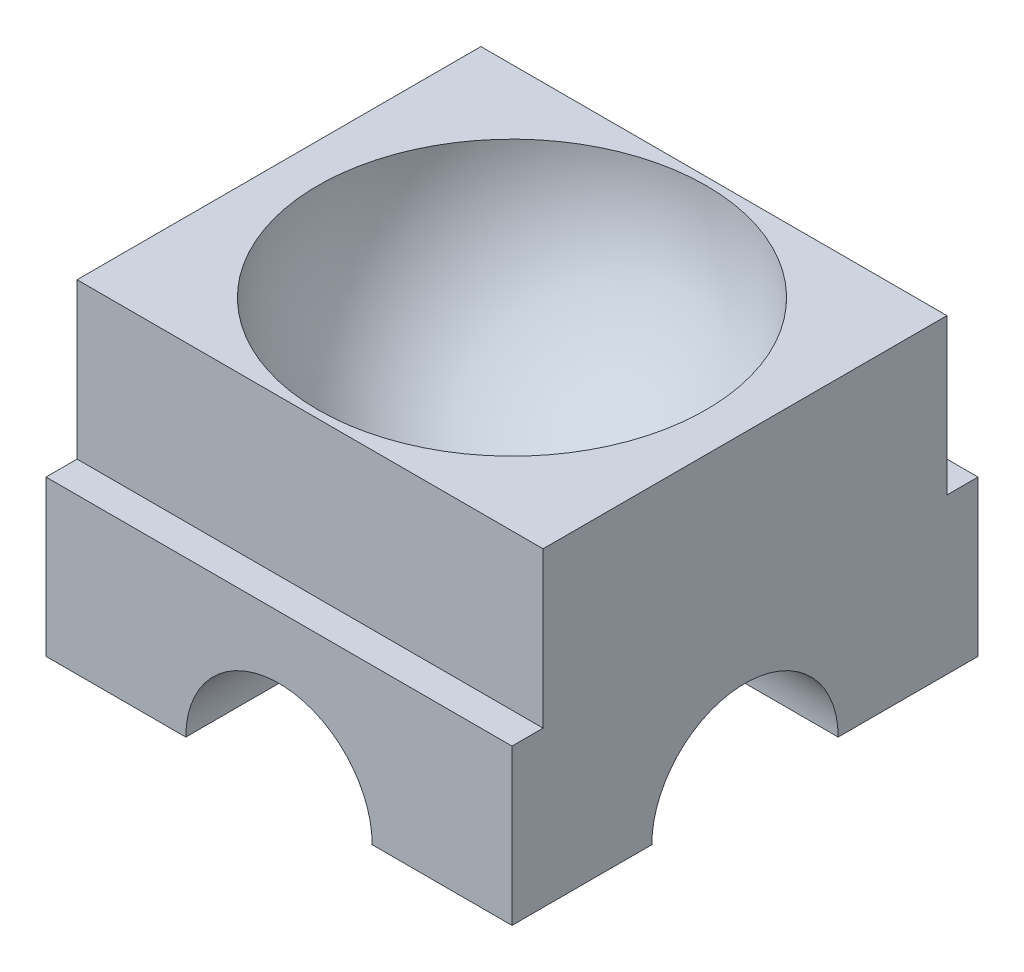
ISO-10303-21;
HEADER;
FILE_DESCRIPTION(('STEP AP214'),'2;1');
FILE_NAME('part.step','',(''),(''),'','','');
FILE_SCHEMA(('AUTOMOTIVE_DESIGN { 1 0 10303 214 1 1 1 1 }'));
ENDSEC;
DATA;
#1=APPLICATION_CONTEXT('core data for automotive mechanical design processes');
#2=APPLICATION_PROTOCOL_DEFINITION('international standard','automotive_design',2000,#1);
#3=PRODUCT_CONTEXT('',#1,'mechanical');
#4=PRODUCT('Part','Part','',(#3));
#5=PRODUCT_RELATED_PRODUCT_CATEGORY('part','',(#4));
#6=PRODUCT_DEFINITION_FORMATION('','',#4);
#7=PRODUCT_DEFINITION_CONTEXT('part definition',#1,'design');
#8=PRODUCT_DEFINITION('design','',#6,#7);
#9=PRODUCT_DEFINITION_SHAPE('','',#8);
#10=(LENGTH_UNIT() NAMED_UNIT(*) SI_UNIT(.MILLI.,.METRE.));
#11=(NAMED_UNIT(*) PLANE_ANGLE_UNIT() SI_UNIT($,.RADIAN.));
#12=(NAMED_UNIT(*) SI_UNIT($,.STERADIAN.) SOLID_ANGLE_UNIT());
#13=UNCERTAINTY_MEASURE_WITH_UNIT(LENGTH_MEASURE(1.E-05),#10,'distance_accuracy_value','');
#14=(GEOMETRIC_REPRESENTATION_CONTEXT(3) GLOBAL_UNCERTAINTY_ASSIGNED_CONTEXT((#13)) GLOBAL_UNIT_ASSIGNED_CONTEXT((#10,
#11,#12)) REPRESENTATION_CONTEXT('',''));
#15=CARTESIAN_POINT('',(0.,0.,0.));
#16=DIRECTION('',(0.,0.,1.));
#17=DIRECTION('',(1.,0.,0.));
#18=AXIS2_PLACEMENT_3D('',#15,#16,#17);
#19=CARTESIAN_POINT('',(0.,20.,0.));
#20=DIRECTION('',(0.,-1.,0.));
#21=DIRECTION('',(0.,0.,-1.));
#22=AXIS2_PLACEMENT_3D('',#19,#20,#21);
#23=PLANE('',#22);
#24=CARTESIAN_POINT('',(0.,20.,0.));
#25=DIRECTION('',(0.,-1.,0.));
#26=DIRECTION('',(0.,0.,-1.));
#27=AXIS2_PLACEMENT_3D('',#24,#25,#26);
#28=CIRCLE('',#27,12.5);
#29=CARTESIAN_POINT('',(0.,20.,-12.5));
#30=VERTEX_POINT('',#29);
#31=EDGE_CURVE('E321',#30,#30,#28,.T.);
#32=ORIENTED_EDGE('',*,*,#31,.T.);
#33=EDGE_LOOP('',(#32));
#34=FACE_BOUND('',#33,.T.);
#35=DIRECTION('',(1.,0.,0.));
#36=VECTOR('',#35,1.);
#37=CARTESIAN_POINT('',(15.,20.,-13.));
#38=LINE('',#37,#36);
#39=CARTESIAN_POINT('',(-15.,20.,-13.));
#40=VERTEX_POINT('',#39);
#41=CARTESIAN_POINT('',(15.,20.,-13.));
#42=VERTEX_POINT('',#41);
#43=EDGE_CURVE('E169',#40,#42,#38,.T.);
#44=ORIENTED_EDGE('',*,*,#43,.F.);
#45=DIRECTION('',(0.,0.,1.));
#46=VECTOR('',#45,1.);
#47=CARTESIAN_POINT('',(-15.,20.,-15.));
#48=LINE('',#47,#46);
#49=CARTESIAN_POINT('',(-15.,20.,13.));
#50=VERTEX_POINT('',#49);
#51=EDGE_CURVE('E351',#40,#50,#48,.T.);
#52=ORIENTED_EDGE('',*,*,#51,.T.);
#53=DIRECTION('',(-1.,0.,0.));
#54=VECTOR('',#53,1.);
#55=CARTESIAN_POINT('',(15.,20.,13.));
#56=LINE('',#55,#54);
#57=CARTESIAN_POINT('',(15.,20.,13.));
#58=VERTEX_POINT('',#57);
#59=EDGE_CURVE('E191',#58,#50,#56,.T.);
#60=ORIENTED_EDGE('',*,*,#59,.F.);
#61=DIRECTION('',(0.,0.,-1.));
#62=VECTOR('',#61,1.);
#63=CARTESIAN_POINT('',(15.,20.,-15.));
#64=LINE('',#63,#62);
#65=EDGE_CURVE('E356',#58,#42,#64,.T.);
#66=ORIENTED_EDGE('',*,*,#65,.T.);
#67=EDGE_LOOP('',(#44,#52,#60,#66));
#68=FACE_BOUND('',#67,.T.);
#69=ADVANCED_FACE('F39',(#34,#68),#23,.F.);
#70=CARTESIAN_POINT('',(0.,0.,0.));
#71=DIRECTION('',(0.,-1.,0.));
#72=DIRECTION('',(0.,0.,-1.));
#73=AXIS2_PLACEMENT_3D('',#70,#71,#72);
#74=PLANE('',#73);
#75=DIRECTION('',(1.,0.,0.));
#76=VECTOR('',#75,1.);
#77=CARTESIAN_POINT('',(-15.,0.,-6.));
#78=LINE('',#77,#76);
#79=CARTESIAN_POINT('',(6.00000000000001,0.,-6.));
#80=VERTEX_POINT('',#79);
#81=CARTESIAN_POINT('',(15.,0.,-6.));
#82=VERTEX_POINT('',#81);
#83=EDGE_CURVE('E346',#80,#82,#78,.T.);
#84=ORIENTED_EDGE('',*,*,#83,.F.);
#85=DIRECTION('',(0.,0.,1.));
#86=VECTOR('',#85,1.);
#87=CARTESIAN_POINT('',(6.,0.,-15.));
#88=LINE('',#87,#86);
#89=CARTESIAN_POINT('',(6.,0.,-15.));
#90=VERTEX_POINT('',#89);
#91=EDGE_CURVE('E309',#90,#80,#88,.T.);
#92=ORIENTED_EDGE('',*,*,#91,.F.);
#93=DIRECTION('',(-1.,0.,0.));
#94=VECTOR('',#93,1.);
#95=CARTESIAN_POINT('',(15.,0.,-15.));
#96=LINE('',#95,#94);
#97=CARTESIAN_POINT('',(15.,0.,-15.));
#98=VERTEX_POINT('',#97);
#99=EDGE_CURVE('E345',#98,#90,#96,.T.);
#100=ORIENTED_EDGE('',*,*,#99,.F.);
#101=DIRECTION('',(0.,0.,-1.));
#102=VECTOR('',#101,1.);
#103=CARTESIAN_POINT('',(15.,0.,-15.));
#104=LINE('',#103,#102);
#105=EDGE_CURVE('E374',#82,#98,#104,.T.);
#106=ORIENTED_EDGE('',*,*,#105,.F.);
#107=EDGE_LOOP('',(#84,#92,#100,#106));
#108=FACE_BOUND('',#107,.T.);
#109=ADVANCED_FACE('F265',(#108),#74,.T.);
#110=DIRECTION('',(1.,0.,0.));
#111=VECTOR('',#110,1.);
#112=CARTESIAN_POINT('',(-15.,0.,-6.));
#113=LINE('',#112,#111);
#114=CARTESIAN_POINT('',(-15.,0.,-6.));
#115=VERTEX_POINT('',#114);
#116=CARTESIAN_POINT('',(-6.,0.,-5.99999999999999));
#117=VERTEX_POINT('',#116);
#118=EDGE_CURVE('E329',#115,#117,#113,.T.);
#119=ORIENTED_EDGE('',*,*,#118,.F.);
#120=DIRECTION('',(0.,0.,1.));
#121=VECTOR('',#120,1.);
#122=CARTESIAN_POINT('',(-15.,0.,-15.));
#123=LINE('',#122,#121);
#124=CARTESIAN_POINT('',(-15.,0.,-15.));
#125=VERTEX_POINT('',#124);
#126=EDGE_CURVE('E368',#125,#115,#123,.T.);
#127=ORIENTED_EDGE('',*,*,#126,.F.);
#128=CARTESIAN_POINT('',(-6.,0.,-15.));
#129=VERTEX_POINT('',#128);
#130=EDGE_CURVE('E352',#129,#125,#96,.T.);
#131=ORIENTED_EDGE('',*,*,#130,.F.);
#132=DIRECTION('',(0.,0.,1.));
#133=VECTOR('',#132,1.);
#134=CARTESIAN_POINT('',(-6.,0.,-15.));
#135=LINE('',#134,#133);
#136=EDGE_CURVE('E298',#117,#129,#135,.F.);
#137=ORIENTED_EDGE('',*,*,#136,.F.);
#138=EDGE_LOOP('',(#119,#127,#131,#137));
#139=FACE_BOUND('',#138,.T.);
#140=ADVANCED_FACE('F404',(#139),#74,.T.);
#141=CARTESIAN_POINT('',(0.,0.,-15.));
#142=DIRECTION('',(0.,0.,1.));
#143=DIRECTION('',(1.,0.,0.));
#144=AXIS2_PLACEMENT_3D('',#141,#142,#143);
#145=CYLINDRICAL_SURFACE('',#144,6.);
#146=CARTESIAN_POINT('',(0.,0.,0.));
#147=DIRECTION('',(0.707106781186547,0.,0.707106781186547));
#148=DIRECTION('',(-0.707106781186547,0.,0.707106781186548));
#149=AXIS2_PLACEMENT_3D('',#146,#147,#148);
#150=ELLIPSE('',#149,8.48528137423857,6.);
#151=CARTESIAN_POINT('',(-6.,0.,6.));
#152=VERTEX_POINT('',#151);
#153=CARTESIAN_POINT('',(-2.65165042944955,5.38226253540275,2.65165042944955));
#154=VERTEX_POINT('',#153);
#155=EDGE_CURVE('E11',#152,#154,#150,.F.);
#156=ORIENTED_EDGE('',*,*,#155,.T.);
#157=CARTESIAN_POINT('',(-3.74891984443519,4.68461311102635,-0.0899999999999981));
#158=CARTESIAN_POINT('',(-3.75116440280366,4.68279123621888,0.00257539191768942));
#159=CARTESIAN_POINT('',(-3.74993736965723,4.68379561847137,0.0952693057548459));
#160=CARTESIAN_POINT('',(-3.74066773205659,4.69121558616772,0.280010994935022));
#161=CARTESIAN_POINT('',(-3.73263172402658,4.69762593437133,0.372059308733181));
#162=CARTESIAN_POINT('',(-3.70997412955914,4.71553604484638,0.55401765986375));
#163=CARTESIAN_POINT('',(-3.69541016850703,4.72699125853147,0.643939310773065));
#164=CARTESIAN_POINT('',(-3.65996855710083,4.75448562212782,0.821804120626023));
#165=CARTESIAN_POINT('',(-3.63908971681884,4.77052563593269,0.909746903328337));
#166=CARTESIAN_POINT('',(-3.56758782633547,4.82450936414541,1.16912356367238));
#167=CARTESIAN_POINT('',(-3.50799264587564,4.86840733391543,1.33693276001089));
#168=CARTESIAN_POINT('',(-3.36717163177248,4.96684131595492,1.66008521786203));
#169=CARTESIAN_POINT('',(-3.28589409544518,5.02140267134646,1.81539751222952));
#170=CARTESIAN_POINT('',(-3.09239761625433,5.14312253023135,2.13021527327504));
#171=CARTESIAN_POINT('',(-2.97759020953785,5.21100401773592,2.28784797996866));
#172=CARTESIAN_POINT('',(-2.72507693198501,5.34738541696695,2.58345445989727));
#173=CARTESIAN_POINT('',(-2.58736081447893,5.41588559239732,2.72141938456413));
#174=CARTESIAN_POINT('',(-2.35438336883668,5.5195582659026,2.92093186740058));
#175=CARTESIAN_POINT('',(-2.26615846571416,5.55645368805525,2.98992431234766));
#176=CARTESIAN_POINT('',(-2.08318853164442,5.62760553518381,3.12016412433438));
#177=CARTESIAN_POINT('',(-1.98844623745631,5.6618630552044,3.18141471201772));
#178=CARTESIAN_POINT('',(-1.79288966306264,5.72679352967591,3.29558295729569));
#179=CARTESIAN_POINT('',(-1.69207509786285,5.75746631568297,3.34850022335464));
#180=CARTESIAN_POINT('',(-1.48505184375017,5.81430383461426,3.44531051953376));
#181=CARTESIAN_POINT('',(-1.37884681364601,5.84047157375316,3.4892095713119));
#182=CARTESIAN_POINT('',(-1.17090484643763,5.88551890494119,3.56407758927238));
#183=CARTESIAN_POINT('',(-1.06953971544513,5.9048255723895,3.59582199107257));
#184=CARTESIAN_POINT('',(-0.86374889228564,5.93841702278807,3.65072167933629));
#185=CARTESIAN_POINT('',(-0.759325015281024,5.95270472127637,3.6738819527849));
#186=CARTESIAN_POINT('',(-0.548367848614511,5.97582995046071,3.7112341189297));
#187=CARTESIAN_POINT('',(-0.441836194280986,5.9846715476409,3.72543270331818));
#188=CARTESIAN_POINT('',(-0.227633106999719,5.9966393512623,3.74462826402819));
#189=CARTESIAN_POINT('',(-0.119961833857269,5.99976634863885,3.74962651373264));
#190=CARTESIAN_POINT('',(0.0801139692075001,6.00017713029772,3.75028310303194));
#191=CARTESIAN_POINT('',(0.172515816762383,5.99822742856036,3.7471666542167));
#192=CARTESIAN_POINT('',(0.356681608425346,5.99009814615963,3.73414005555203));
#193=CARTESIAN_POINT('',(0.448445349480516,5.9839172761939,3.7242278349245));
#194=CARTESIAN_POINT('',(0.630600038306196,5.96747013518993,3.69774367237254));
#195=CARTESIAN_POINT('',(0.72099149334269,5.95720541390353,3.68117425671646));
#196=CARTESIAN_POINT('',(0.899835851886057,5.93282901544797,3.64159289290878));
#197=CARTESIAN_POINT('',(0.988287990175259,5.91871584825295,3.61857844930381));
#198=CARTESIAN_POINT('',(1.24734813204354,5.87150178001913,3.54100731163605));
#199=CARTESIAN_POINT('',(1.41444467600927,5.833259795376,3.47750570627198));
#200=CARTESIAN_POINT('',(1.73551663617314,5.74593464003765,3.3289429835232));
#201=CARTESIAN_POINT('',(1.88948949552122,5.69684936343512,3.24387767771537));
#202=CARTESIAN_POINT('',(2.19930480177451,5.58508658991678,3.04358338658586));
#203=CARTESIAN_POINT('',(2.35329482268006,5.52149305401284,2.9260008427881));
#204=CARTESIAN_POINT('',(2.64060152417693,5.3900146075081,2.66962239808274));
#205=CARTESIAN_POINT('',(2.77389054332392,5.32212412269352,2.53079859697894));
#206=CARTESIAN_POINT('',(3.03490116340259,5.17827097093637,2.21352919626679));
#207=CARTESIAN_POINT('',(3.159314618163,5.10248762358444,2.03225950326231));
#208=CARTESIAN_POINT('',(3.37589725321461,4.96185565956469,1.64755109111826));
#209=CARTESIAN_POINT('',(3.46810381968707,4.89699441000304,1.44413843817223));
#210=CARTESIAN_POINT('',(3.59781631954875,4.80214132095425,1.07098935878969));
#211=CARTESIAN_POINT('',(3.64318979165473,4.76749958362925,0.905216144684538));
#212=CARTESIAN_POINT('',(3.69398973422995,4.72809429022024,0.651453132027872));
#213=CARTESIAN_POINT('',(3.70804170710345,4.7170561388471,0.566089601428861));
#214=CARTESIAN_POINT('',(3.7302334395148,4.69952831846797,0.3941514408884));
#215=CARTESIAN_POINT('',(3.73837638560932,4.6930361979934,0.307577489403636));
#216=CARTESIAN_POINT('',(3.74654661229813,4.68651271603566,0.169038099302509));
#217=CARTESIAN_POINT('',(3.74852473176975,4.6849299011085,0.11724813362726));
#218=CARTESIAN_POINT('',(3.75033329200901,4.68348129517973,0.0136271448516045));
#219=CARTESIAN_POINT('',(3.75016457470199,4.68361483107673,-0.0382038541831283));
#220=CARTESIAN_POINT('',(3.74891984443519,4.68461311102636,-0.089999999999998));
#221=B_SPLINE_CURVE_WITH_KNOTS('',3,(#157,#158,#159,#160,#161,#162,#163,#164,#165,#166,#167,
#168,#169,#170,#171,#172,#173,#174,#175,#176,#177,#178,#179,#180,#181,#182,#183,#184,#185,#186,
#187,#188,#189,#190,#191,#192,#193,#194,#195,#196,#197,#198,#199,#200,#201,#202,#203,#204,#205,
#206,#207,#208,#209,#210,#211,#212,#213,#214,#215,#216,#217,#218,#219,#220),.UNSPECIFIED.,.F.,
.F.,(4,2,2,2,2,2,2,2,2,2,2,2,2,2,2,2,2,2,2,2,2,2,2,2,2,2,2,2,2,2,2,4),(0.,0.277723535123664,
0.555178323423032,0.830230699372583,1.10533493642781,1.65305965758059,2.20210231525013,
2.81930030182728,3.43677509634909,3.79013705522397,4.14335152687412,4.49658258912825,
4.84957701914046,5.17297956082498,5.49619392486589,5.81916665836193,6.14209468708282,
6.41917798209975,6.69634574628424,6.97340843020572,7.25057853883181,7.79653555960689,
8.34259870564966,8.95196385714659,9.56213638624226,10.2565341348646,10.9501231174539,
11.4737403136575,11.7351052542589,11.9963291438196,12.1518189678738,12.3072478153373),.UNSPECIFIED.);
#222=CARTESIAN_POINT('',(2.65165042944955,5.38226253540275,2.65165042944955));
#223=VERTEX_POINT('',#222);
#224=EDGE_CURVE('E241',#154,#223,#221,.T.);
#225=ORIENTED_EDGE('',*,*,#224,.T.);
#226=CARTESIAN_POINT('',(0.,0.,0.));
#227=DIRECTION('',(-0.707106781186547,0.,0.707106781186548));
#228=DIRECTION('',(0.707106781186547,0.,0.707106781186547));
#229=AXIS2_PLACEMENT_3D('',#226,#227,#228);
#230=ELLIPSE('',#229,8.48528137423857,6.);
#231=CARTESIAN_POINT('',(6.,0.,6.));
#232=VERTEX_POINT('',#231);
#233=EDGE_CURVE('E313',#223,#232,#230,.F.);
#234=ORIENTED_EDGE('',*,*,#233,.T.);
#235=CARTESIAN_POINT('',(6.,0.,15.));
#236=VERTEX_POINT('',#235);
#237=EDGE_CURVE('E308',#232,#236,#88,.T.);
#238=ORIENTED_EDGE('',*,*,#237,.T.);
#239=CARTESIAN_POINT('',(0.,0.,15.));
#240=DIRECTION('',(0.,0.,-1.));
#241=DIRECTION('',(-1.,0.,0.));
#242=AXIS2_PLACEMENT_3D('',#239,#240,#241);
#243=CIRCLE('',#242,6.);
#244=CARTESIAN_POINT('',(-6.,0.,15.));
#245=VERTEX_POINT('',#244);
#246=EDGE_CURVE('E381',#245,#236,#243,.T.);
#247=ORIENTED_EDGE('',*,*,#246,.F.);
#248=EDGE_CURVE('E304',#245,#152,#135,.F.);
#249=ORIENTED_EDGE('',*,*,#248,.T.);
#250=EDGE_LOOP('',(#156,#225,#234,#238,#247,#249));
#251=FACE_BOUND('',#250,.T.);
#252=ADVANCED_FACE('F261',(#251),#145,.F.);
#253=DIRECTION('',(1.,0.,0.));
#254=VECTOR('',#253,1.);
#255=CARTESIAN_POINT('',(-15.,0.,6.));
#256=LINE('',#255,#254);
#257=CARTESIAN_POINT('',(15.,0.,6.));
#258=VERTEX_POINT('',#257);
#259=EDGE_CURVE('E393',#258,#232,#256,.F.);
#260=ORIENTED_EDGE('',*,*,#259,.F.);
#261=CARTESIAN_POINT('',(15.,0.,15.));
#262=VERTEX_POINT('',#261);
#263=EDGE_CURVE('E358',#262,#258,#104,.T.);
#264=ORIENTED_EDGE('',*,*,#263,.F.);
#265=DIRECTION('',(1.,0.,0.));
#266=VECTOR('',#265,1.);
#267=CARTESIAN_POINT('',(15.,0.,15.));
#268=LINE('',#267,#266);
#269=EDGE_CURVE('E290',#236,#262,#268,.T.);
#270=ORIENTED_EDGE('',*,*,#269,.F.);
#271=ORIENTED_EDGE('',*,*,#237,.F.);
#272=EDGE_LOOP('',(#260,#264,#270,#271));
#273=FACE_BOUND('',#272,.T.);
#274=ADVANCED_FACE('F271',(#273),#74,.T.);
#275=CARTESIAN_POINT('',(-15.,20.,-15.));
#276=DIRECTION('',(1.,0.,0.));
#277=DIRECTION('',(0.,0.,-1.));
#278=AXIS2_PLACEMENT_3D('',#275,#276,#277);
#279=PLANE('',#278);
#280=DIRECTION('',(0.,1.,0.));
#281=VECTOR('',#280,1.);
#282=CARTESIAN_POINT('',(-15.,20.,-13.));
#283=LINE('',#282,#281);
#284=CARTESIAN_POINT('',(-15.,10.,-13.));
#285=VERTEX_POINT('',#284);
#286=EDGE_CURVE('E163',#285,#40,#283,.T.);
#287=ORIENTED_EDGE('',*,*,#286,.F.);
#288=DIRECTION('',(0.,0.,-1.));
#289=VECTOR('',#288,1.);
#290=CARTESIAN_POINT('',(-15.,10.,-13.));
#291=LINE('',#290,#289);
#292=CARTESIAN_POINT('',(-15.,10.,-15.));
#293=VERTEX_POINT('',#292);
#294=EDGE_CURVE('E159',#285,#293,#291,.T.);
#295=ORIENTED_EDGE('',*,*,#294,.T.);
#296=DIRECTION('',(0.,-1.,0.));
#297=VECTOR('',#296,1.);
#298=CARTESIAN_POINT('',(-15.,20.,-15.));
#299=LINE('',#298,#297);
#300=EDGE_CURVE('E300',#293,#125,#299,.T.);
#301=ORIENTED_EDGE('',*,*,#300,.T.);
#302=ORIENTED_EDGE('',*,*,#126,.T.);
#303=CARTESIAN_POINT('',(-15.,0.,0.));
#304=DIRECTION('',(1.,0.,0.));
#305=DIRECTION('',(0.,0.,-1.));
#306=AXIS2_PLACEMENT_3D('',#303,#304,#305);
#307=CIRCLE('',#306,6.);
#308=CARTESIAN_POINT('',(-15.,0.,6.));
#309=VERTEX_POINT('',#308);
#310=EDGE_CURVE('E324',#115,#309,#307,.T.);
#311=ORIENTED_EDGE('',*,*,#310,.T.);
#312=CARTESIAN_POINT('',(-15.,0.,15.));
#313=VERTEX_POINT('',#312);
#314=EDGE_CURVE('E370',#309,#313,#123,.T.);
#315=ORIENTED_EDGE('',*,*,#314,.T.);
#316=DIRECTION('',(0.,-1.,0.));
#317=VECTOR('',#316,1.);
#318=CARTESIAN_POINT('',(-15.,20.,15.));
#319=LINE('',#318,#317);
#320=CARTESIAN_POINT('',(-15.,10.,15.));
#321=VERTEX_POINT('',#320);
#322=EDGE_CURVE('E294',#321,#313,#319,.T.);
#323=ORIENTED_EDGE('',*,*,#322,.F.);
#324=DIRECTION('',(0.,0.,1.));
#325=VECTOR('',#324,1.);
#326=CARTESIAN_POINT('',(-15.,10.,13.));
#327=LINE('',#326,#325);
#328=CARTESIAN_POINT('',(-15.,10.,13.));
#329=VERTEX_POINT('',#328);
#330=EDGE_CURVE('E200',#329,#321,#327,.T.);
#331=ORIENTED_EDGE('',*,*,#330,.F.);
#332=DIRECTION('',(0.,-1.,0.));
#333=VECTOR('',#332,1.);
#334=CARTESIAN_POINT('',(-15.,10.,13.));
#335=LINE('',#334,#333);
#336=EDGE_CURVE('E194',#50,#329,#335,.T.);
#337=ORIENTED_EDGE('',*,*,#336,.F.);
#338=ORIENTED_EDGE('',*,*,#51,.F.);
#339=EDGE_LOOP('',(#287,#295,#301,#302,#311,#315,#323,#331,#337,#338));
#340=FACE_BOUND('',#339,.T.);
#341=ADVANCED_FACE('F41',(#340),#279,.F.);
#342=CARTESIAN_POINT('',(15.,20.,15.));
#343=DIRECTION('',(0.,0.,-1.));
#344=DIRECTION('',(-1.,0.,0.));
#345=AXIS2_PLACEMENT_3D('',#342,#343,#344);
#346=PLANE('',#345);
#347=DIRECTION('',(0.,-1.,0.));
#348=VECTOR('',#347,1.);
#349=CARTESIAN_POINT('',(15.,20.,15.));
#350=LINE('',#349,#348);
#351=CARTESIAN_POINT('',(15.,10.,15.));
#352=VERTEX_POINT('',#351);
#353=EDGE_CURVE('E286',#352,#262,#350,.T.);
#354=ORIENTED_EDGE('',*,*,#353,.F.);
#355=DIRECTION('',(1.,0.,0.));
#356=VECTOR('',#355,1.);
#357=CARTESIAN_POINT('',(15.,10.,15.));
#358=LINE('',#357,#356);
#359=EDGE_CURVE('E184',#321,#352,#358,.T.);
#360=ORIENTED_EDGE('',*,*,#359,.F.);
#361=ORIENTED_EDGE('',*,*,#322,.T.);
#362=EDGE_CURVE('E371',#313,#245,#268,.T.);
#363=ORIENTED_EDGE('',*,*,#362,.T.);
#364=ORIENTED_EDGE('',*,*,#246,.T.);
#365=ORIENTED_EDGE('',*,*,#269,.T.);
#366=EDGE_LOOP('',(#354,#360,#361,#363,#364,#365));
#367=FACE_BOUND('',#366,.T.);
#368=ADVANCED_FACE('F276',(#367),#346,.F.);
#369=CARTESIAN_POINT('',(15.,20.,-15.));
#370=DIRECTION('',(-1.,0.,0.));
#371=DIRECTION('',(0.,0.,1.));
#372=AXIS2_PLACEMENT_3D('',#369,#370,#371);
#373=PLANE('',#372);
#374=DIRECTION('',(0.,-1.,0.));
#375=VECTOR('',#374,1.);
#376=CARTESIAN_POINT('',(15.,20.,-15.));
#377=LINE('',#376,#375);
#378=CARTESIAN_POINT('',(15.,10.,-15.));
#379=VERTEX_POINT('',#378);
#380=EDGE_CURVE('E179',#379,#98,#377,.T.);
#381=ORIENTED_EDGE('',*,*,#380,.F.);
#382=DIRECTION('',(0.,0.,-1.));
#383=VECTOR('',#382,1.);
#384=CARTESIAN_POINT('',(15.,10.,-13.));
#385=LINE('',#384,#383);
#386=CARTESIAN_POINT('',(15.,10.,-13.));
#387=VERTEX_POINT('',#386);
#388=EDGE_CURVE('E57',#387,#379,#385,.T.);
#389=ORIENTED_EDGE('',*,*,#388,.F.);
#390=DIRECTION('',(0.,-1.,0.));
#391=VECTOR('',#390,1.);
#392=CARTESIAN_POINT('',(15.,20.,-13.));
#393=LINE('',#392,#391);
#394=EDGE_CURVE('E164',#42,#387,#393,.T.);
#395=ORIENTED_EDGE('',*,*,#394,.F.);
#396=ORIENTED_EDGE('',*,*,#65,.F.);
#397=DIRECTION('',(0.,1.,0.));
#398=VECTOR('',#397,1.);
#399=CARTESIAN_POINT('',(15.,10.,13.));
#400=LINE('',#399,#398);
#401=CARTESIAN_POINT('',(15.,10.,13.));
#402=VERTEX_POINT('',#401);
#403=EDGE_CURVE('E65',#402,#58,#400,.T.);
#404=ORIENTED_EDGE('',*,*,#403,.F.);
#405=DIRECTION('',(0.,0.,1.));
#406=VECTOR('',#405,1.);
#407=CARTESIAN_POINT('',(15.,10.,13.));
#408=LINE('',#407,#406);
#409=EDGE_CURVE('E203',#402,#352,#408,.T.);
#410=ORIENTED_EDGE('',*,*,#409,.T.);
#411=ORIENTED_EDGE('',*,*,#353,.T.);
#412=ORIENTED_EDGE('',*,*,#263,.T.);
#413=CARTESIAN_POINT('',(15.,0.,0.));
#414=DIRECTION('',(-1.,0.,0.));
#415=DIRECTION('',(0.,0.,1.));
#416=AXIS2_PLACEMENT_3D('',#413,#414,#415);
#417=CIRCLE('',#416,6.);
#418=EDGE_CURVE('E389',#258,#82,#417,.T.);
#419=ORIENTED_EDGE('',*,*,#418,.T.);
#420=ORIENTED_EDGE('',*,*,#105,.T.);
#421=EDGE_LOOP('',(#381,#389,#395,#396,#404,#410,#411,#412,#419,#420));
#422=FACE_BOUND('',#421,.T.);
#423=ADVANCED_FACE('F177',(#422),#373,.F.);
#424=CARTESIAN_POINT('',(15.,20.,-15.));
#425=DIRECTION('',(0.,0.,1.));
#426=DIRECTION('',(1.,0.,0.));
#427=AXIS2_PLACEMENT_3D('',#424,#425,#426);
#428=PLANE('',#427);
#429=ORIENTED_EDGE('',*,*,#300,.F.);
#430=DIRECTION('',(-1.,0.,0.));
#431=VECTOR('',#430,1.);
#432=CARTESIAN_POINT('',(15.,10.,-15.));
#433=LINE('',#432,#431);
#434=EDGE_CURVE('E174',#379,#293,#433,.T.);
#435=ORIENTED_EDGE('',*,*,#434,.F.);
#436=ORIENTED_EDGE('',*,*,#380,.T.);
#437=ORIENTED_EDGE('',*,*,#99,.T.);
#438=CARTESIAN_POINT('',(0.,0.,-15.));
#439=DIRECTION('',(0.,0.,1.));
#440=DIRECTION('',(1.,0.,0.));
#441=AXIS2_PLACEMENT_3D('',#438,#439,#440);
#442=CIRCLE('',#441,6.);
#443=EDGE_CURVE('E340',#90,#129,#442,.T.);
#444=ORIENTED_EDGE('',*,*,#443,.T.);
#445=ORIENTED_EDGE('',*,*,#130,.T.);
#446=EDGE_LOOP('',(#429,#435,#436,#437,#444,#445));
#447=FACE_BOUND('',#446,.T.);
#448=ADVANCED_FACE('F269',(#447),#428,.F.);
#449=DIRECTION('',(1.,0.,0.));
#450=VECTOR('',#449,1.);
#451=CARTESIAN_POINT('',(-15.,0.,6.));
#452=LINE('',#451,#450);
#453=EDGE_CURVE('E384',#152,#309,#452,.F.);
#454=ORIENTED_EDGE('',*,*,#453,.F.);
#455=ORIENTED_EDGE('',*,*,#248,.F.);
#456=ORIENTED_EDGE('',*,*,#362,.F.);
#457=ORIENTED_EDGE('',*,*,#314,.F.);
#458=EDGE_LOOP('',(#454,#455,#456,#457));
#459=FACE_BOUND('',#458,.T.);
#460=ADVANCED_FACE('F259',(#459),#74,.T.);
#461=CARTESIAN_POINT('',(0.,0.,0.));
#462=DIRECTION('',(0.707106781186547,0.,0.707106781186547));
#463=DIRECTION('',(-0.707106781186547,0.,0.707106781186548));
#464=AXIS2_PLACEMENT_3D('',#461,#462,#463);
#465=ELLIPSE('',#464,8.48528137423857,6.);
#466=CARTESIAN_POINT('',(2.65165042944955,5.38226253540275,-2.65165042944955));
#467=VERTEX_POINT('',#466);
#468=EDGE_CURVE('E49',#80,#467,#465,.T.);
#469=ORIENTED_EDGE('',*,*,#468,.T.);
#470=CARTESIAN_POINT('',(3.74891984443519,4.68461311102636,0.0900000000000015));
#471=CARTESIAN_POINT('',(3.75116440280366,4.68279123621889,-0.00257539191768583));
#472=CARTESIAN_POINT('',(3.74993736965723,4.68379561847138,-0.0952693057548425));
#473=CARTESIAN_POINT('',(3.74066773205659,4.69121558616772,-0.280010994935019));
#474=CARTESIAN_POINT('',(3.73263172402658,4.69762593437134,-0.372059308733177));
#475=CARTESIAN_POINT('',(3.70997412955914,4.71553604484638,-0.554017659863747));
#476=CARTESIAN_POINT('',(3.69541016850703,4.72699125853147,-0.643939310773062));
#477=CARTESIAN_POINT('',(3.65996855710083,4.75448562212783,-0.821804120626019));
#478=CARTESIAN_POINT('',(3.63908971681884,4.77052563593269,-0.909746903328333));
#479=CARTESIAN_POINT('',(3.56758782633547,4.82450936414541,-1.16912356367238));
#480=CARTESIAN_POINT('',(3.50799264587564,4.86840733391543,-1.33693276001089));
#481=CARTESIAN_POINT('',(3.36717163177249,4.96684131595492,-1.66008521786202));
#482=CARTESIAN_POINT('',(3.28589409544519,5.02140267134646,-1.81539751222951));
#483=CARTESIAN_POINT('',(3.09239761625433,5.14312253023135,-2.13021527327503));
#484=CARTESIAN_POINT('',(2.97759020953785,5.21100401773593,-2.28784797996866));
#485=CARTESIAN_POINT('',(2.72507693198501,5.34738541696695,-2.58345445989727));
#486=CARTESIAN_POINT('',(2.58736081447894,5.41588559239733,-2.72141938456413));
#487=CARTESIAN_POINT('',(2.35438336883668,5.5195582659026,-2.92093186740058));
#488=CARTESIAN_POINT('',(2.26615846571416,5.55645368805525,-2.98992431234766));
#489=CARTESIAN_POINT('',(2.08318853164442,5.62760553518381,-3.12016412433438));
#490=CARTESIAN_POINT('',(1.98844623745631,5.6618630552044,-3.18141471201771));
#491=CARTESIAN_POINT('',(1.79288966306264,5.72679352967591,-3.29558295729569));
#492=CARTESIAN_POINT('',(1.69207509786285,5.75746631568297,-3.34850022335464));
#493=CARTESIAN_POINT('',(1.48505184375018,5.81430383461426,-3.44531051953375));
#494=CARTESIAN_POINT('',(1.37884681364602,5.84047157375316,-3.4892095713119));
#495=CARTESIAN_POINT('',(1.17090484643764,5.88551890494119,-3.56407758927238));
#496=CARTESIAN_POINT('',(1.06953971544513,5.9048255723895,-3.59582199107257));
#497=CARTESIAN_POINT('',(0.863748892285644,5.93841702278807,-3.65072167933629));
#498=CARTESIAN_POINT('',(0.759325015281029,5.95270472127637,-3.6738819527849));
#499=CARTESIAN_POINT('',(0.548367848614516,5.97582995046071,-3.7112341189297));
#500=CARTESIAN_POINT('',(0.441836194280991,5.9846715476409,-3.72543270331818));
#501=CARTESIAN_POINT('',(0.227633106999724,5.9966393512623,-3.74462826402819));
#502=CARTESIAN_POINT('',(0.119961833857274,5.99976634863885,-3.74962651373264));
#503=CARTESIAN_POINT('',(-0.0801139692074948,6.00017713029772,-3.75028310303194));
#504=CARTESIAN_POINT('',(-0.172515816762378,5.99822742856036,-3.7471666542167));
#505=CARTESIAN_POINT('',(-0.356681608425341,5.99009814615963,-3.73414005555203));
#506=CARTESIAN_POINT('',(-0.448445349480511,5.9839172761939,-3.7242278349245));
#507=CARTESIAN_POINT('',(-0.630600038306192,5.96747013518993,-3.69774367237254));
#508=CARTESIAN_POINT('',(-0.720991493342685,5.95720541390354,-3.68117425671646));
#509=CARTESIAN_POINT('',(-0.899835851886053,5.93282901544797,-3.64159289290878));
#510=CARTESIAN_POINT('',(-0.988287990175254,5.91871584825295,-3.61857844930381));
#511=CARTESIAN_POINT('',(-1.24734813204354,5.87150178001913,-3.54100731163605));
#512=CARTESIAN_POINT('',(-1.41444467600927,5.833259795376,-3.47750570627198));
#513=CARTESIAN_POINT('',(-1.73551663617314,5.74593464003765,-3.3289429835232));
#514=CARTESIAN_POINT('',(-1.88948949552122,5.69684936343512,-3.24387767771537));
#515=CARTESIAN_POINT('',(-2.19930480177451,5.58508658991678,-3.04358338658586));
#516=CARTESIAN_POINT('',(-2.35329482268006,5.52149305401284,-2.92600084278811));
#517=CARTESIAN_POINT('',(-2.64060152417693,5.3900146075081,-2.66962239808275));
#518=CARTESIAN_POINT('',(-2.77389054332392,5.32212412269351,-2.53079859697894));
#519=CARTESIAN_POINT('',(-3.03490116340259,5.17827097093637,-2.21352919626679));
#520=CARTESIAN_POINT('',(-3.15931461816299,5.10248762358443,-2.03225950326232));
#521=CARTESIAN_POINT('',(-3.37589725321461,4.96185565956469,-1.64755109111827));
#522=CARTESIAN_POINT('',(-3.46810381968707,4.89699441000303,-1.44413843817223));
#523=CARTESIAN_POINT('',(-3.59781631954875,4.80214132095425,-1.0709893587897));
#524=CARTESIAN_POINT('',(-3.64318979165473,4.76749958362925,-0.905216144684544));
#525=CARTESIAN_POINT('',(-3.69398973422995,4.72809429022023,-0.651453132027879));
#526=CARTESIAN_POINT('',(-3.70804170710345,4.7170561388471,-0.566089601428868));
#527=CARTESIAN_POINT('',(-3.7302334395148,4.69952831846796,-0.394151440888407));
#528=CARTESIAN_POINT('',(-3.73837638560932,4.6930361979934,-0.307577489403643));
#529=CARTESIAN_POINT('',(-3.74654661229813,4.68651271603566,-0.169038099302514));
#530=CARTESIAN_POINT('',(-3.74852473176975,4.68492990110849,-0.117248133627263));
#531=CARTESIAN_POINT('',(-3.75033329200901,4.68348129517972,-0.0136271448516044));
#532=CARTESIAN_POINT('',(-3.75016457470199,4.68361483107673,0.0382038541831302));
#533=CARTESIAN_POINT('',(-3.74891984443519,4.68461311102635,0.0900000000000015));
#534=B_SPLINE_CURVE_WITH_KNOTS('',3,(#470,#471,#472,#473,#474,#475,#476,#477,#478,#479,#480,
#481,#482,#483,#484,#485,#486,#487,#488,#489,#490,#491,#492,#493,#494,#495,#496,#497,#498,#499,
#500,#501,#502,#503,#504,#505,#506,#507,#508,#509,#510,#511,#512,#513,#514,#515,#516,#517,#518,
#519,#520,#521,#522,#523,#524,#525,#526,#527,#528,#529,#530,#531,#532,#533),.UNSPECIFIED.,.F.,
.F.,(4,2,2,2,2,2,2,2,2,2,2,2,2,2,2,2,2,2,2,2,2,2,2,2,2,2,2,2,2,2,2,4),(0.,0.277723535123664,
0.555178323423032,0.830230699372583,1.1053349364278,1.65305965758059,2.20210231525013,
2.81930030182728,3.43677509634909,3.79013705522397,4.14335152687412,4.49658258912825,
4.84957701914046,5.17297956082498,5.49619392486589,5.81916665836193,6.14209468708282,
6.41917798209975,6.69634574628424,6.97340843020572,7.25057853883181,7.79653555960689,
8.34259870564966,8.95196385714659,9.56213638624226,10.2565341348646,10.9501231174539,
11.4737403136575,11.7351052542589,11.9963291438196,12.1518189678738,12.3072478153373),.UNSPECIFIED.);
#535=CARTESIAN_POINT('',(-2.65165042944955,5.38226253540275,-2.65165042944955));
#536=VERTEX_POINT('',#535);
#537=EDGE_CURVE('E219',#467,#536,#534,.T.);
#538=ORIENTED_EDGE('',*,*,#537,.T.);
#539=CARTESIAN_POINT('',(0.,0.,0.));
#540=DIRECTION('',(-0.707106781186547,0.,0.707106781186548));
#541=DIRECTION('',(0.707106781186547,0.,0.707106781186547));
#542=AXIS2_PLACEMENT_3D('',#539,#540,#541);
#543=ELLIPSE('',#542,8.48528137423857,6.);
#544=EDGE_CURVE('E316',#536,#117,#543,.T.);
#545=ORIENTED_EDGE('',*,*,#544,.T.);
#546=ORIENTED_EDGE('',*,*,#136,.T.);
#547=ORIENTED_EDGE('',*,*,#443,.F.);
#548=ORIENTED_EDGE('',*,*,#91,.T.);
#549=EDGE_LOOP('',(#469,#538,#545,#546,#547,#548));
#550=FACE_BOUND('',#549,.T.);
#551=ADVANCED_FACE('F254',(#550),#145,.F.);
#552=CARTESIAN_POINT('',(-15.,0.,0.));
#553=DIRECTION('',(1.,0.,0.));
#554=DIRECTION('',(0.,0.,-1.));
#555=AXIS2_PLACEMENT_3D('',#552,#553,#554);
#556=CYLINDRICAL_SURFACE('',#555,6.);
#557=ORIENTED_EDGE('',*,*,#233,.F.);
#558=CARTESIAN_POINT('',(-0.0900000000000011,4.68461311102635,3.74891984443519));
#559=CARTESIAN_POINT('',(0.00257539191768619,4.68279123621889,3.75116440280366));
#560=CARTESIAN_POINT('',(0.0952693057548428,4.68379561847138,3.74993736965723));
#561=CARTESIAN_POINT('',(0.280010994935019,4.69121558616772,3.74066773205659));
#562=CARTESIAN_POINT('',(0.372059308733177,4.69762593437133,3.73263172402658));
#563=CARTESIAN_POINT('',(0.554017659863747,4.71553604484638,3.70997412955914));
#564=CARTESIAN_POINT('',(0.643939310773062,4.72699125853147,3.69541016850703));
#565=CARTESIAN_POINT('',(0.82180412062602,4.75448562212782,3.65996855710083));
#566=CARTESIAN_POINT('',(0.909746903328333,4.77052563593269,3.63908971681884));
#567=CARTESIAN_POINT('',(1.16912356367238,4.82450936414541,3.56758782633547));
#568=CARTESIAN_POINT('',(1.33693276001089,4.86840733391543,3.50799264587564));
#569=CARTESIAN_POINT('',(1.66008521786202,4.96684131595492,3.36717163177249));
#570=CARTESIAN_POINT('',(1.81539751222951,5.02140267134646,3.28589409544519));
#571=CARTESIAN_POINT('',(2.13021527327503,5.14312253023135,3.09239761625433));
#572=CARTESIAN_POINT('',(2.28784797996866,5.21100401773592,2.97759020953785));
#573=CARTESIAN_POINT('',(2.58345445989727,5.34738541696695,2.72507693198501));
#574=CARTESIAN_POINT('',(2.72141938456413,5.41588559239732,2.58736081447894));
#575=CARTESIAN_POINT('',(2.92093186740058,5.5195582659026,2.35438336883669));
#576=CARTESIAN_POINT('',(2.98992431234766,5.55645368805525,2.26615846571417));
#577=CARTESIAN_POINT('',(3.12016412433438,5.6276055351838,2.08318853164442));
#578=CARTESIAN_POINT('',(3.18141471201771,5.6618630552044,1.98844623745631));
#579=CARTESIAN_POINT('',(3.29558295729569,5.72679352967591,1.79288966306265));
#580=CARTESIAN_POINT('',(3.34850022335463,5.75746631568297,1.69207509786285));
#581=CARTESIAN_POINT('',(3.44531051953375,5.81430383461426,1.48505184375018));
#582=CARTESIAN_POINT('',(3.4892095713119,5.84047157375316,1.37884681364602));
#583=CARTESIAN_POINT('',(3.56407758927238,5.88551890494119,1.17090484643764));
#584=CARTESIAN_POINT('',(3.59582199107257,5.9048255723895,1.06953971544513));
#585=CARTESIAN_POINT('',(3.65072167933629,5.93841702278806,0.863748892285646));
#586=CARTESIAN_POINT('',(3.6738819527849,5.95270472127637,0.75932501528103));
#587=CARTESIAN_POINT('',(3.7112341189297,5.97582995046071,0.548367848614518));
#588=CARTESIAN_POINT('',(3.72543270331818,5.9846715476409,0.441836194280993));
#589=CARTESIAN_POINT('',(3.74462826402819,5.9966393512623,0.227633106999726));
#590=CARTESIAN_POINT('',(3.74962651373264,5.99976634863885,0.119961833857276));
#591=CARTESIAN_POINT('',(3.75028310303194,6.00017713029772,-0.0801139692074932));
#592=CARTESIAN_POINT('',(3.7471666542167,5.99822742856036,-0.172515816762376));
#593=CARTESIAN_POINT('',(3.73414005555203,5.99009814615963,-0.356681608425339));
#594=CARTESIAN_POINT('',(3.7242278349245,5.9839172761939,-0.44844534948051));
#595=CARTESIAN_POINT('',(3.69774367237254,5.96747013518993,-0.630600038306191));
#596=CARTESIAN_POINT('',(3.68117425671646,5.95720541390354,-0.720991493342684));
#597=CARTESIAN_POINT('',(3.64159289290878,5.93282901544797,-0.899835851886052));
#598=CARTESIAN_POINT('',(3.61857844930381,5.91871584825295,-0.988287990175254));
#599=CARTESIAN_POINT('',(3.54100731163605,5.87150178001913,-1.24734813204354));
#600=CARTESIAN_POINT('',(3.47750570627198,5.833259795376,-1.41444467600927));
#601=CARTESIAN_POINT('',(3.3289429835232,5.74593464003765,-1.73551663617313));
#602=CARTESIAN_POINT('',(3.24387767771537,5.69684936343512,-1.88948949552122));
#603=CARTESIAN_POINT('',(3.04358338658586,5.58508658991679,-2.19930480177451));
#604=CARTESIAN_POINT('',(2.92600084278811,5.52149305401284,-2.35329482268006));
#605=CARTESIAN_POINT('',(2.66962239808275,5.39001460750811,-2.64060152417693));
#606=CARTESIAN_POINT('',(2.53079859697894,5.32212412269352,-2.77389054332392));
#607=CARTESIAN_POINT('',(2.21352919626679,5.17827097093637,-3.03490116340259));
#608=CARTESIAN_POINT('',(2.03225950326232,5.10248762358443,-3.15931461816299));
#609=CARTESIAN_POINT('',(1.64755109111827,4.96185565956469,-3.37589725321461));
#610=CARTESIAN_POINT('',(1.44413843817223,4.89699441000303,-3.46810381968707));
#611=CARTESIAN_POINT('',(1.0709893587897,4.80214132095425,-3.59781631954875));
#612=CARTESIAN_POINT('',(0.905216144684544,4.76749958362925,-3.64318979165473));
#613=CARTESIAN_POINT('',(0.651453132027877,4.72809429022024,-3.69398973422995));
#614=CARTESIAN_POINT('',(0.566089601428865,4.7170561388471,-3.70804170710345));
#615=CARTESIAN_POINT('',(0.394151440888404,4.69952831846796,-3.7302334395148));
#616=CARTESIAN_POINT('',(0.307577489403641,4.6930361979934,-3.73837638560932));
#617=CARTESIAN_POINT('',(0.169038099302513,4.68651271603566,-3.74654661229813));
#618=CARTESIAN_POINT('',(0.117248133627262,4.6849299011085,-3.74852473176975));
#619=CARTESIAN_POINT('',(0.0136271448516038,4.68348129517973,-3.75033329200901));
#620=CARTESIAN_POINT('',(-0.0382038541831306,4.68361483107673,-3.75016457470199));
#621=CARTESIAN_POINT('',(-0.0900000000000019,4.68461311102635,-3.74891984443519));
#622=B_SPLINE_CURVE_WITH_KNOTS('',3,(#558,#559,#560,#561,#562,#563,#564,#565,#566,#567,#568,
#569,#570,#571,#572,#573,#574,#575,#576,#577,#578,#579,#580,#581,#582,#583,#584,#585,#586,#587,
#588,#589,#590,#591,#592,#593,#594,#595,#596,#597,#598,#599,#600,#601,#602,#603,#604,#605,#606,
#607,#608,#609,#610,#611,#612,#613,#614,#615,#616,#617,#618,#619,#620,#621),.UNSPECIFIED.,.F.,
.F.,(4,2,2,2,2,2,2,2,2,2,2,2,2,2,2,2,2,2,2,2,2,2,2,2,2,2,2,2,2,2,2,4),(0.,0.277723535123664,
0.555178323423032,0.830230699372583,1.1053349364278,1.65305965758059,2.20210231525013,
2.81930030182728,3.43677509634909,3.79013705522397,4.14335152687412,4.49658258912825,
4.84957701914046,5.17297956082498,5.49619392486589,5.81916665836193,6.14209468708281,
6.41917798209974,6.69634574628424,6.97340843020572,7.25057853883181,7.79653555960689,
8.34259870564966,8.95196385714659,9.56213638624226,10.2565341348646,10.9501231174539,
11.4737403136575,11.7351052542589,11.9963291438196,12.1518189678738,12.3072478153373),.UNSPECIFIED.);
#623=EDGE_CURVE('E248',#223,#467,#622,.T.);
#624=ORIENTED_EDGE('',*,*,#623,.T.);
#625=ORIENTED_EDGE('',*,*,#468,.F.);
#626=ORIENTED_EDGE('',*,*,#83,.T.);
#627=ORIENTED_EDGE('',*,*,#418,.F.);
#628=ORIENTED_EDGE('',*,*,#259,.T.);
#629=EDGE_LOOP('',(#557,#624,#625,#626,#627,#628));
#630=FACE_BOUND('',#629,.T.);
#631=ADVANCED_FACE('F258',(#630),#556,.F.);
#632=ORIENTED_EDGE('',*,*,#544,.F.);
#633=CARTESIAN_POINT('',(0.0899999999999976,4.68461311102635,-3.74891984443519));
#634=CARTESIAN_POINT('',(-0.00257539191768964,4.68279123621889,-3.75116440280366));
#635=CARTESIAN_POINT('',(-0.0952693057548463,4.68379561847138,-3.74993736965723));
#636=CARTESIAN_POINT('',(-0.280010994935023,4.69121558616772,-3.74066773205659));
#637=CARTESIAN_POINT('',(-0.372059308733181,4.69762593437133,-3.73263172402658));
#638=CARTESIAN_POINT('',(-0.554017659863751,4.71553604484638,-3.70997412955914));
#639=CARTESIAN_POINT('',(-0.643939310773066,4.72699125853147,-3.69541016850703));
#640=CARTESIAN_POINT('',(-0.821804120626024,4.75448562212783,-3.65996855710083));
#641=CARTESIAN_POINT('',(-0.909746903328337,4.77052563593269,-3.63908971681884));
#642=CARTESIAN_POINT('',(-1.16912356367238,4.82450936414541,-3.56758782633547));
#643=CARTESIAN_POINT('',(-1.33693276001089,4.86840733391543,-3.50799264587564));
#644=CARTESIAN_POINT('',(-1.66008521786203,4.96684131595492,-3.36717163177248));
#645=CARTESIAN_POINT('',(-1.81539751222952,5.02140267134646,-3.28589409544518));
#646=CARTESIAN_POINT('',(-2.13021527327504,5.14312253023135,-3.09239761625433));
#647=CARTESIAN_POINT('',(-2.28784797996866,5.21100401773592,-2.97759020953785));
#648=CARTESIAN_POINT('',(-2.58345445989727,5.34738541696695,-2.72507693198501));
#649=CARTESIAN_POINT('',(-2.72141938456413,5.41588559239733,-2.58736081447893));
#650=CARTESIAN_POINT('',(-2.92093186740058,5.5195582659026,-2.35438336883668));
#651=CARTESIAN_POINT('',(-2.98992431234766,5.55645368805525,-2.26615846571416));
#652=CARTESIAN_POINT('',(-3.12016412433438,5.62760553518381,-2.08318853164442));
#653=CARTESIAN_POINT('',(-3.18141471201772,5.6618630552044,-1.98844623745631));
#654=CARTESIAN_POINT('',(-3.29558295729569,5.72679352967591,-1.79288966306264));
#655=CARTESIAN_POINT('',(-3.34850022335464,5.75746631568297,-1.69207509786285));
#656=CARTESIAN_POINT('',(-3.44531051953376,5.81430383461426,-1.48505184375017));
#657=CARTESIAN_POINT('',(-3.4892095713119,5.84047157375316,-1.37884681364601));
#658=CARTESIAN_POINT('',(-3.56407758927238,5.88551890494119,-1.17090484643763));
#659=CARTESIAN_POINT('',(-3.59582199107257,5.9048255723895,-1.06953971544513));
#660=CARTESIAN_POINT('',(-3.65072167933629,5.93841702278807,-0.863748892285639));
#661=CARTESIAN_POINT('',(-3.6738819527849,5.95270472127637,-0.759325015281023));
#662=CARTESIAN_POINT('',(-3.7112341189297,5.97582995046071,-0.548367848614511));
#663=CARTESIAN_POINT('',(-3.72543270331818,5.9846715476409,-0.441836194280985));
#664=CARTESIAN_POINT('',(-3.74462826402819,5.9966393512623,-0.227633106999718));
#665=CARTESIAN_POINT('',(-3.74962651373264,5.99976634863885,-0.119961833857268));
#666=CARTESIAN_POINT('',(-3.75028310303194,6.00017713029772,0.0801139692075011));
#667=CARTESIAN_POINT('',(-3.7471666542167,5.99822742856036,0.172515816762384));
#668=CARTESIAN_POINT('',(-3.73414005555203,5.99009814615963,0.356681608425347));
#669=CARTESIAN_POINT('',(-3.7242278349245,5.9839172761939,0.448445349480517));
#670=CARTESIAN_POINT('',(-3.69774367237254,5.96747013518993,0.630600038306198));
#671=CARTESIAN_POINT('',(-3.68117425671646,5.95720541390353,0.720991493342691));
#672=CARTESIAN_POINT('',(-3.64159289290878,5.93282901544797,0.899835851886058));
#673=CARTESIAN_POINT('',(-3.61857844930381,5.91871584825295,0.98828799017526));
#674=CARTESIAN_POINT('',(-3.54100731163605,5.87150178001913,1.24734813204354));
#675=CARTESIAN_POINT('',(-3.47750570627198,5.833259795376,1.41444467600927));
#676=CARTESIAN_POINT('',(-3.3289429835232,5.74593464003764,1.73551663617314));
#677=CARTESIAN_POINT('',(-3.24387767771537,5.69684936343512,1.88948949552122));
#678=CARTESIAN_POINT('',(-3.04358338658586,5.58508658991678,2.19930480177451));
#679=CARTESIAN_POINT('',(-2.9260008427881,5.52149305401284,2.35329482268006));
#680=CARTESIAN_POINT('',(-2.66962239808274,5.3900146075081,2.64060152417693));
#681=CARTESIAN_POINT('',(-2.53079859697894,5.32212412269351,2.77389054332392));
#682=CARTESIAN_POINT('',(-2.21352919626679,5.17827097093637,3.03490116340259));
#683=CARTESIAN_POINT('',(-2.03225950326231,5.10248762358443,3.159314618163));
#684=CARTESIAN_POINT('',(-1.64755109111826,4.96185565956469,3.37589725321461));
#685=CARTESIAN_POINT('',(-1.44413843817223,4.89699441000303,3.46810381968707));
#686=CARTESIAN_POINT('',(-1.07098935878969,4.80214132095425,3.59781631954875));
#687=CARTESIAN_POINT('',(-0.905216144684538,4.76749958362925,3.64318979165473));
#688=CARTESIAN_POINT('',(-0.651453132027872,4.72809429022024,3.69398973422995));
#689=CARTESIAN_POINT('',(-0.56608960142886,4.7170561388471,3.70804170710345));
#690=CARTESIAN_POINT('',(-0.394151440888399,4.69952831846796,3.7302334395148));
#691=CARTESIAN_POINT('',(-0.307577489403636,4.6930361979934,3.73837638560932));
#692=CARTESIAN_POINT('',(-0.169038099302509,4.68651271603566,3.74654661229813));
#693=CARTESIAN_POINT('',(-0.11724813362726,4.6849299011085,3.74852473176975));
#694=CARTESIAN_POINT('',(-0.0136271448516048,4.68348129517973,3.75033329200901));
#695=CARTESIAN_POINT('',(0.0382038541831285,4.68361483107673,3.75016457470199));
#696=CARTESIAN_POINT('',(0.0899999999999986,4.68461311102635,3.74891984443519));
#697=B_SPLINE_CURVE_WITH_KNOTS('',3,(#633,#634,#635,#636,#637,#638,#639,#640,#641,#642,#643,
#644,#645,#646,#647,#648,#649,#650,#651,#652,#653,#654,#655,#656,#657,#658,#659,#660,#661,#662,
#663,#664,#665,#666,#667,#668,#669,#670,#671,#672,#673,#674,#675,#676,#677,#678,#679,#680,#681,
#682,#683,#684,#685,#686,#687,#688,#689,#690,#691,#692,#693,#694,#695,#696),.UNSPECIFIED.,.F.,
.F.,(4,2,2,2,2,2,2,2,2,2,2,2,2,2,2,2,2,2,2,2,2,2,2,2,2,2,2,2,2,2,2,4),(0.,0.277723535123664,
0.555178323423032,0.830230699372583,1.10533493642781,1.6530596575806,2.20210231525014,
2.81930030182728,3.43677509634909,3.79013705522397,4.14335152687412,4.49658258912825,
4.84957701914047,5.17297956082498,5.49619392486589,5.81916665836193,6.14209468708282,
6.41917798209975,6.69634574628425,6.97340843020572,7.25057853883181,7.79653555960689,
8.34259870564966,8.95196385714659,9.56213638624226,10.2565341348646,10.9501231174539,
11.4737403136575,11.7351052542589,11.9963291438196,12.1518189678738,12.3072478153373),.UNSPECIFIED.);
#698=EDGE_CURVE('E209',#536,#154,#697,.T.);
#699=ORIENTED_EDGE('',*,*,#698,.T.);
#700=ORIENTED_EDGE('',*,*,#155,.F.);
#701=ORIENTED_EDGE('',*,*,#453,.T.);
#702=ORIENTED_EDGE('',*,*,#310,.F.);
#703=ORIENTED_EDGE('',*,*,#118,.T.);
#704=EDGE_LOOP('',(#632,#699,#700,#701,#702,#703));
#705=FACE_BOUND('',#704,.T.);
#706=ADVANCED_FACE('F226',(#705),#556,.F.);
#707=CARTESIAN_POINT('',(0.,20.,0.));
#708=DIRECTION('',(1.,0.,0.));
#709=DIRECTION('',(0.,0.,1.));
#710=AXIS2_PLACEMENT_3D('',#707,#708,#709);
#711=SPHERICAL_SURFACE('',#710,12.5);
#712=CARTESIAN_POINT('',(0.,20.,0.));
#713=DIRECTION('',(0.,1.,0.));
#714=DIRECTION('',(0.,0.,1.));
#715=AXIS2_PLACEMENT_3D('',#712,#713,#714);
#716=SPHERICAL_SURFACE('',#715,12.5);
#717=CARTESIAN_POINT('',(0.,8.07575998228818,0.));
#718=DIRECTION('',(0.,1.,0.));
#719=DIRECTION('',(0.,0.,1.));
#720=AXIS2_PLACEMENT_3D('',#717,#718,#719);
#721=CIRCLE('',#720,3.75);
#722=CARTESIAN_POINT('',(0.,8.07575998228818,3.75));
#723=VERTEX_POINT('',#722);
#724=EDGE_CURVE('E43',#723,#723,#721,.F.);
#725=ORIENTED_EDGE('',*,*,#724,.T.);
#726=EDGE_LOOP('',(#725));
#727=FACE_BOUND('',#726,.T.);
#728=ORIENTED_EDGE('',*,*,#31,.F.);
#729=EDGE_LOOP('',(#728));
#730=FACE_BOUND('',#729,.T.);
#731=ADVANCED_FACE('F234',(#727,#730),#716,.F.);
#732=CARTESIAN_POINT('',(0.,0.,0.));
#733=DIRECTION('',(0.,1.,0.));
#734=DIRECTION('',(0.,0.,1.));
#735=AXIS2_PLACEMENT_3D('',#732,#733,#734);
#736=CYLINDRICAL_SURFACE('',#735,3.75);
#737=ORIENTED_EDGE('',*,*,#724,.F.);
#738=EDGE_LOOP('',(#737));
#739=FACE_BOUND('',#738,.T.);
#740=ORIENTED_EDGE('',*,*,#224,.F.);
#741=ORIENTED_EDGE('',*,*,#698,.F.);
#742=ORIENTED_EDGE('',*,*,#537,.F.);
#743=ORIENTED_EDGE('',*,*,#623,.F.);
#744=EDGE_LOOP('',(#740,#741,#742,#743));
#745=FACE_BOUND('',#744,.T.);
#746=ADVANCED_FACE('F229',(#739,#745),#736,.F.);
#747=CARTESIAN_POINT('',(15.,10.,13.));
#748=DIRECTION('',(0.,-1.,0.));
#749=DIRECTION('',(0.,0.,-1.));
#750=AXIS2_PLACEMENT_3D('',#747,#748,#749);
#751=PLANE('',#750);
#752=ORIENTED_EDGE('',*,*,#359,.T.);
#753=ORIENTED_EDGE('',*,*,#409,.F.);
#754=DIRECTION('',(1.,0.,0.));
#755=VECTOR('',#754,1.);
#756=CARTESIAN_POINT('',(15.,10.,13.));
#757=LINE('',#756,#755);
#758=EDGE_CURVE('E197',#329,#402,#757,.T.);
#759=ORIENTED_EDGE('',*,*,#758,.F.);
#760=ORIENTED_EDGE('',*,*,#330,.T.);
#761=EDGE_LOOP('',(#752,#753,#759,#760));
#762=FACE_BOUND('',#761,.T.);
#763=ADVANCED_FACE('F233',(#762),#751,.F.);
#764=CARTESIAN_POINT('',(0.,0.,13.));
#765=DIRECTION('',(0.,0.,1.));
#766=DIRECTION('',(1.,0.,0.));
#767=AXIS2_PLACEMENT_3D('',#764,#765,#766);
#768=PLANE('',#767);
#769=ORIENTED_EDGE('',*,*,#403,.T.);
#770=ORIENTED_EDGE('',*,*,#59,.T.);
#771=ORIENTED_EDGE('',*,*,#336,.T.);
#772=ORIENTED_EDGE('',*,*,#758,.T.);
#773=EDGE_LOOP('',(#769,#770,#771,#772));
#774=FACE_BOUND('',#773,.T.);
#775=ADVANCED_FACE('F435',(#774),#768,.T.);
#776=CARTESIAN_POINT('',(15.,10.,-13.));
#777=DIRECTION('',(0.,-1.,0.));
#778=DIRECTION('',(0.,0.,-1.));
#779=AXIS2_PLACEMENT_3D('',#776,#777,#778);
#780=PLANE('',#779);
#781=ORIENTED_EDGE('',*,*,#434,.T.);
#782=ORIENTED_EDGE('',*,*,#294,.F.);
#783=DIRECTION('',(-1.,0.,0.));
#784=VECTOR('',#783,1.);
#785=CARTESIAN_POINT('',(15.,10.,-13.));
#786=LINE('',#785,#784);
#787=EDGE_CURVE('E155',#387,#285,#786,.T.);
#788=ORIENTED_EDGE('',*,*,#787,.F.);
#789=ORIENTED_EDGE('',*,*,#388,.T.);
#790=EDGE_LOOP('',(#781,#782,#788,#789));
#791=FACE_BOUND('',#790,.T.);
#792=ADVANCED_FACE('F157',(#791),#780,.F.);
#793=CARTESIAN_POINT('',(0.,0.,-13.));
#794=DIRECTION('',(0.,0.,-1.));
#795=DIRECTION('',(-1.,0.,0.));
#796=AXIS2_PLACEMENT_3D('',#793,#794,#795);
#797=PLANE('',#796);
#798=ORIENTED_EDGE('',*,*,#394,.T.);
#799=ORIENTED_EDGE('',*,*,#787,.T.);
#800=ORIENTED_EDGE('',*,*,#286,.T.);
#801=ORIENTED_EDGE('',*,*,#43,.T.);
#802=EDGE_LOOP('',(#798,#799,#800,#801));
#803=FACE_BOUND('',#802,.T.);
#804=ADVANCED_FACE('F167',(#803),#797,.T.);
#805=CLOSED_SHELL('',(#69,#109,#140,#252,#274,#341,#368,#423,#448,#460,#551,#631,#706,#731,#746,
#763,#775,#792,#804));
#806=MANIFOLD_SOLID_BREP('B2',#805);
#807=ADVANCED_BREP_SHAPE_REPRESENTATION('',(#18,#806),#14);
#808=SHAPE_DEFINITION_REPRESENTATION(#9,#807);
ENDSEC;
END-ISO-10303-21;
